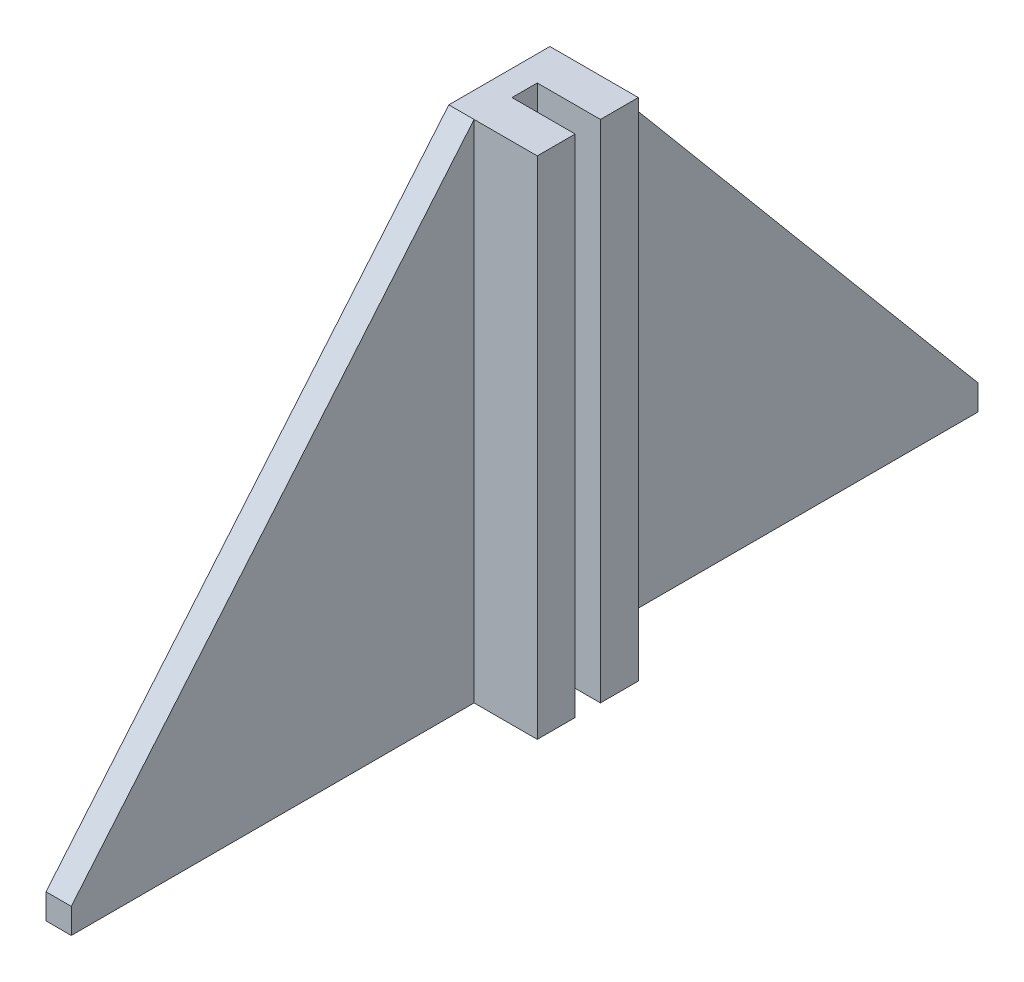
ISO-10303-21;
HEADER;
FILE_DESCRIPTION(('STEP AP214'),'2;1');
FILE_NAME('part.step','',(''),(''),'','','');
FILE_SCHEMA(('AUTOMOTIVE_DESIGN { 1 0 10303 214 1 1 1 1 }'));
ENDSEC;
DATA;
#1=APPLICATION_CONTEXT('core data for automotive mechanical design processes');
#2=APPLICATION_PROTOCOL_DEFINITION('international standard','automotive_design',2000,#1);
#3=PRODUCT_CONTEXT('',#1,'mechanical');
#4=PRODUCT('Part','Part','',(#3));
#5=PRODUCT_RELATED_PRODUCT_CATEGORY('part','',(#4));
#6=PRODUCT_DEFINITION_FORMATION('','',#4);
#7=PRODUCT_DEFINITION_CONTEXT('part definition',#1,'design');
#8=PRODUCT_DEFINITION('design','',#6,#7);
#9=PRODUCT_DEFINITION_SHAPE('','',#8);
#10=(LENGTH_UNIT() NAMED_UNIT(*) SI_UNIT(.MILLI.,.METRE.));
#11=(NAMED_UNIT(*) PLANE_ANGLE_UNIT() SI_UNIT($,.RADIAN.));
#12=(NAMED_UNIT(*) SI_UNIT($,.STERADIAN.) SOLID_ANGLE_UNIT());
#13=UNCERTAINTY_MEASURE_WITH_UNIT(LENGTH_MEASURE(1.E-05),#10,'distance_accuracy_value','');
#14=(GEOMETRIC_REPRESENTATION_CONTEXT(3) GLOBAL_UNCERTAINTY_ASSIGNED_CONTEXT((#13)) GLOBAL_UNIT_ASSIGNED_CONTEXT((#10,
#11,#12)) REPRESENTATION_CONTEXT('',''));
#15=CARTESIAN_POINT('',(0.,0.,0.));
#16=DIRECTION('',(0.,0.,1.));
#17=DIRECTION('',(1.,0.,0.));
#18=AXIS2_PLACEMENT_3D('',#15,#16,#17);
#19=CARTESIAN_POINT('',(20.,0.,0.));
#20=DIRECTION('',(-1.,0.,0.));
#21=DIRECTION('',(0.,0.,1.));
#22=AXIS2_PLACEMENT_3D('',#19,#20,#21);
#23=PLANE('',#22);
#24=DIRECTION('',(0.,1.,0.));
#25=VECTOR('',#24,1.);
#26=CARTESIAN_POINT('',(20.,0.,-40.));
#27=LINE('',#26,#25);
#28=CARTESIAN_POINT('',(20.,0.,-40.));
#29=VERTEX_POINT('',#28);
#30=CARTESIAN_POINT('',(20.,400.,-40.));
#31=VERTEX_POINT('',#30);
#32=EDGE_CURVE('E161',#29,#31,#27,.T.);
#33=ORIENTED_EDGE('',*,*,#32,.F.);
#34=DIRECTION('',(0.,0.,-1.));
#35=VECTOR('',#34,1.);
#36=CARTESIAN_POINT('',(20.,0.,358.857859847365));
#37=LINE('',#36,#35);
#38=CARTESIAN_POINT('',(20.,0.,-358.857859847365));
#39=VERTEX_POINT('',#38);
#40=EDGE_CURVE('E224',#29,#39,#37,.T.);
#41=ORIENTED_EDGE('',*,*,#40,.T.);
#42=DIRECTION('',(0.,1.,0.));
#43=VECTOR('',#42,1.);
#44=CARTESIAN_POINT('',(20.,0.,-358.857859847365));
#45=LINE('',#44,#43);
#46=CARTESIAN_POINT('',(20.,20.,-358.857859847365));
#47=VERTEX_POINT('',#46);
#48=EDGE_CURVE('E207',#39,#47,#45,.T.);
#49=ORIENTED_EDGE('',*,*,#48,.T.);
#50=DIRECTION('',(0.,0.766044443118979,0.642787609686538));
#51=VECTOR('',#50,1.);
#52=CARTESIAN_POINT('',(20.,400.,-40.));
#53=LINE('',#52,#51);
#54=EDGE_CURVE('E211',#47,#31,#53,.T.);
#55=ORIENTED_EDGE('',*,*,#54,.T.);
#56=EDGE_LOOP('',(#33,#41,#49,#55));
#57=FACE_BOUND('',#56,.T.);
#58=ADVANCED_FACE('F41',(#57),#23,.F.);
#59=DIRECTION('',(0.,-1.,0.));
#60=VECTOR('',#59,1.);
#61=CARTESIAN_POINT('',(20.,400.,-10.));
#62=LINE('',#61,#60);
#63=CARTESIAN_POINT('',(20.,400.,-10.));
#64=VERTEX_POINT('',#63);
#65=CARTESIAN_POINT('',(20.,0.,-9.99999999999995));
#66=VERTEX_POINT('',#65);
#67=EDGE_CURVE('E57',#64,#66,#62,.T.);
#68=ORIENTED_EDGE('',*,*,#67,.F.);
#69=DIRECTION('',(0.,0.,1.));
#70=VECTOR('',#69,1.);
#71=CARTESIAN_POINT('',(20.,400.,40.));
#72=LINE('',#71,#70);
#73=CARTESIAN_POINT('',(20.,400.,10.));
#74=VERTEX_POINT('',#73);
#75=EDGE_CURVE('E215',#64,#74,#72,.T.);
#76=ORIENTED_EDGE('',*,*,#75,.T.);
#77=DIRECTION('',(0.,1.,0.));
#78=VECTOR('',#77,1.);
#79=CARTESIAN_POINT('',(20.,400.,10.));
#80=LINE('',#79,#78);
#81=CARTESIAN_POINT('',(20.,0.,9.99999999999995));
#82=VERTEX_POINT('',#81);
#83=EDGE_CURVE('E168',#82,#74,#80,.T.);
#84=ORIENTED_EDGE('',*,*,#83,.F.);
#85=EDGE_CURVE('E62',#82,#66,#37,.T.);
#86=ORIENTED_EDGE('',*,*,#85,.T.);
#87=EDGE_LOOP('',(#68,#76,#84,#86));
#88=FACE_BOUND('',#87,.T.);
#89=ADVANCED_FACE('F295',(#88),#23,.F.);
#90=DIRECTION('',(0.,-1.,0.));
#91=VECTOR('',#90,1.);
#92=CARTESIAN_POINT('',(20.,400.,40.));
#93=LINE('',#92,#91);
#94=CARTESIAN_POINT('',(20.,400.,40.));
#95=VERTEX_POINT('',#94);
#96=CARTESIAN_POINT('',(20.,0.,40.));
#97=VERTEX_POINT('',#96);
#98=EDGE_CURVE('E163',#95,#97,#93,.T.);
#99=ORIENTED_EDGE('',*,*,#98,.F.);
#100=DIRECTION('',(0.,-0.766044443118979,0.642787609686538));
#101=VECTOR('',#100,1.);
#102=CARTESIAN_POINT('',(20.,400.,40.));
#103=LINE('',#102,#101);
#104=CARTESIAN_POINT('',(20.,20.,358.857859847365));
#105=VERTEX_POINT('',#104);
#106=EDGE_CURVE('E218',#95,#105,#103,.T.);
#107=ORIENTED_EDGE('',*,*,#106,.T.);
#108=DIRECTION('',(0.,-1.,0.));
#109=VECTOR('',#108,1.);
#110=CARTESIAN_POINT('',(20.,0.,358.857859847365));
#111=LINE('',#110,#109);
#112=CARTESIAN_POINT('',(20.,0.,358.857859847365));
#113=VERTEX_POINT('',#112);
#114=EDGE_CURVE('E221',#105,#113,#111,.T.);
#115=ORIENTED_EDGE('',*,*,#114,.T.);
#116=EDGE_CURVE('E225',#113,#97,#37,.T.);
#117=ORIENTED_EDGE('',*,*,#116,.T.);
#118=EDGE_LOOP('',(#99,#107,#115,#117));
#119=FACE_BOUND('',#118,.T.);
#120=ADVANCED_FACE('F281',(#119),#23,.F.);
#121=CARTESIAN_POINT('',(20.,0.,-358.857859847365));
#122=DIRECTION('',(0.,0.,1.));
#123=DIRECTION('',(1.,0.,0.));
#124=AXIS2_PLACEMENT_3D('',#121,#122,#123);
#125=PLANE('',#124);
#126=DIRECTION('',(0.,1.,0.));
#127=VECTOR('',#126,1.);
#128=CARTESIAN_POINT('',(0.,0.,-358.857859847365));
#129=LINE('',#128,#127);
#130=CARTESIAN_POINT('',(0.,0.,-358.857859847365));
#131=VERTEX_POINT('',#130);
#132=CARTESIAN_POINT('',(0.,20.,-358.857859847365));
#133=VERTEX_POINT('',#132);
#134=EDGE_CURVE('E206',#131,#133,#129,.T.);
#135=ORIENTED_EDGE('',*,*,#134,.T.);
#136=DIRECTION('',(-1.,0.,0.));
#137=VECTOR('',#136,1.);
#138=CARTESIAN_POINT('',(20.,20.,-358.857859847365));
#139=LINE('',#138,#137);
#140=EDGE_CURVE('E11',#47,#133,#139,.T.);
#141=ORIENTED_EDGE('',*,*,#140,.F.);
#142=ORIENTED_EDGE('',*,*,#48,.F.);
#143=DIRECTION('',(-1.,0.,0.));
#144=VECTOR('',#143,1.);
#145=CARTESIAN_POINT('',(20.,0.,-358.857859847365));
#146=LINE('',#145,#144);
#147=EDGE_CURVE('E228',#39,#131,#146,.T.);
#148=ORIENTED_EDGE('',*,*,#147,.T.);
#149=EDGE_LOOP('',(#135,#141,#142,#148));
#150=FACE_BOUND('',#149,.T.);
#151=ADVANCED_FACE('F43',(#150),#125,.F.);
#152=CARTESIAN_POINT('',(20.,400.,-40.));
#153=DIRECTION('',(0.,-0.642787609686538,0.766044443118979));
#154=DIRECTION('',(0.,-0.766044443118979,-0.642787609686538));
#155=AXIS2_PLACEMENT_3D('',#152,#153,#154);
#156=PLANE('',#155);
#157=DIRECTION('',(0.,0.766044443118979,0.642787609686538));
#158=VECTOR('',#157,1.);
#159=CARTESIAN_POINT('',(0.,400.,-40.));
#160=LINE('',#159,#158);
#161=CARTESIAN_POINT('',(0.,400.,-40.));
#162=VERTEX_POINT('',#161);
#163=EDGE_CURVE('E232',#133,#162,#160,.T.);
#164=ORIENTED_EDGE('',*,*,#163,.T.);
#165=DIRECTION('',(-1.,0.,0.));
#166=VECTOR('',#165,1.);
#167=CARTESIAN_POINT('',(20.,400.,-40.));
#168=LINE('',#167,#166);
#169=EDGE_CURVE('E50',#31,#162,#168,.T.);
#170=ORIENTED_EDGE('',*,*,#169,.F.);
#171=ORIENTED_EDGE('',*,*,#54,.F.);
#172=ORIENTED_EDGE('',*,*,#140,.T.);
#173=EDGE_LOOP('',(#164,#170,#171,#172));
#174=FACE_BOUND('',#173,.T.);
#175=ADVANCED_FACE('F307',(#174),#156,.F.);
#176=CARTESIAN_POINT('',(20.,400.,40.));
#177=DIRECTION('',(0.,-1.,0.));
#178=DIRECTION('',(0.,0.,-1.));
#179=AXIS2_PLACEMENT_3D('',#176,#177,#178);
#180=PLANE('',#179);
#181=DIRECTION('',(0.,0.,1.));
#182=VECTOR('',#181,1.);
#183=CARTESIAN_POINT('',(0.,400.,40.));
#184=LINE('',#183,#182);
#185=CARTESIAN_POINT('',(0.,400.,40.));
#186=VERTEX_POINT('',#185);
#187=EDGE_CURVE('E235',#162,#186,#184,.T.);
#188=ORIENTED_EDGE('',*,*,#187,.T.);
#189=DIRECTION('',(-1.,0.,0.));
#190=VECTOR('',#189,1.);
#191=CARTESIAN_POINT('',(20.,400.,40.));
#192=LINE('',#191,#190);
#193=EDGE_CURVE('E257',#95,#186,#192,.T.);
#194=ORIENTED_EDGE('',*,*,#193,.F.);
#195=DIRECTION('',(-1.,0.,0.));
#196=VECTOR('',#195,1.);
#197=CARTESIAN_POINT('',(70.,400.,40.));
#198=LINE('',#197,#196);
#199=CARTESIAN_POINT('',(70.,400.,40.));
#200=VERTEX_POINT('',#199);
#201=EDGE_CURVE('E186',#200,#95,#198,.T.);
#202=ORIENTED_EDGE('',*,*,#201,.F.);
#203=DIRECTION('',(0.,0.,1.));
#204=VECTOR('',#203,1.);
#205=CARTESIAN_POINT('',(70.,400.,40.));
#206=LINE('',#205,#204);
#207=CARTESIAN_POINT('',(70.,400.,10.));
#208=VERTEX_POINT('',#207);
#209=EDGE_CURVE('E184',#208,#200,#206,.T.);
#210=ORIENTED_EDGE('',*,*,#209,.F.);
#211=DIRECTION('',(-1.,0.,0.));
#212=VECTOR('',#211,1.);
#213=CARTESIAN_POINT('',(70.,400.,10.));
#214=LINE('',#213,#212);
#215=EDGE_CURVE('E194',#208,#74,#214,.T.);
#216=ORIENTED_EDGE('',*,*,#215,.T.);
#217=ORIENTED_EDGE('',*,*,#75,.F.);
#218=DIRECTION('',(-1.,0.,0.));
#219=VECTOR('',#218,1.);
#220=CARTESIAN_POINT('',(70.,400.,-10.));
#221=LINE('',#220,#219);
#222=CARTESIAN_POINT('',(70.,400.,-10.));
#223=VERTEX_POINT('',#222);
#224=EDGE_CURVE('E143',#223,#64,#221,.T.);
#225=ORIENTED_EDGE('',*,*,#224,.F.);
#226=DIRECTION('',(0.,0.,1.));
#227=VECTOR('',#226,1.);
#228=CARTESIAN_POINT('',(70.,400.,-40.));
#229=LINE('',#228,#227);
#230=CARTESIAN_POINT('',(70.,400.,-40.));
#231=VERTEX_POINT('',#230);
#232=EDGE_CURVE('E135',#231,#223,#229,.T.);
#233=ORIENTED_EDGE('',*,*,#232,.F.);
#234=DIRECTION('',(-1.,0.,0.));
#235=VECTOR('',#234,1.);
#236=CARTESIAN_POINT('',(70.,400.,-40.));
#237=LINE('',#236,#235);
#238=EDGE_CURVE('E140',#231,#31,#237,.T.);
#239=ORIENTED_EDGE('',*,*,#238,.T.);
#240=ORIENTED_EDGE('',*,*,#169,.T.);
#241=EDGE_LOOP('',(#188,#194,#202,#210,#216,#217,#225,#233,#239,#240));
#242=FACE_BOUND('',#241,.T.);
#243=ADVANCED_FACE('F137',(#242),#180,.F.);
#244=CARTESIAN_POINT('',(20.,400.,40.));
#245=DIRECTION('',(0.,-0.642787609686538,-0.766044443118979));
#246=DIRECTION('',(0.,0.766044443118979,-0.642787609686538));
#247=AXIS2_PLACEMENT_3D('',#244,#245,#246);
#248=PLANE('',#247);
#249=DIRECTION('',(0.,-0.766044443118979,0.642787609686538));
#250=VECTOR('',#249,1.);
#251=CARTESIAN_POINT('',(0.,400.,40.));
#252=LINE('',#251,#250);
#253=CARTESIAN_POINT('',(0.,20.,358.857859847365));
#254=VERTEX_POINT('',#253);
#255=EDGE_CURVE('E238',#186,#254,#252,.T.);
#256=ORIENTED_EDGE('',*,*,#255,.T.);
#257=DIRECTION('',(-1.,0.,0.));
#258=VECTOR('',#257,1.);
#259=CARTESIAN_POINT('',(20.,20.,358.857859847365));
#260=LINE('',#259,#258);
#261=EDGE_CURVE('E253',#105,#254,#260,.T.);
#262=ORIENTED_EDGE('',*,*,#261,.F.);
#263=ORIENTED_EDGE('',*,*,#106,.F.);
#264=ORIENTED_EDGE('',*,*,#193,.T.);
#265=EDGE_LOOP('',(#256,#262,#263,#264));
#266=FACE_BOUND('',#265,.T.);
#267=ADVANCED_FACE('F273',(#266),#248,.F.);
#268=CARTESIAN_POINT('',(20.,0.,358.857859847365));
#269=DIRECTION('',(0.,0.,-1.));
#270=DIRECTION('',(-1.,0.,0.));
#271=AXIS2_PLACEMENT_3D('',#268,#269,#270);
#272=PLANE('',#271);
#273=DIRECTION('',(0.,-1.,0.));
#274=VECTOR('',#273,1.);
#275=CARTESIAN_POINT('',(0.,0.,358.857859847365));
#276=LINE('',#275,#274);
#277=CARTESIAN_POINT('',(0.,0.,358.857859847365));
#278=VERTEX_POINT('',#277);
#279=EDGE_CURVE('E241',#254,#278,#276,.T.);
#280=ORIENTED_EDGE('',*,*,#279,.T.);
#281=DIRECTION('',(-1.,0.,0.));
#282=VECTOR('',#281,1.);
#283=CARTESIAN_POINT('',(20.,0.,358.857859847365));
#284=LINE('',#283,#282);
#285=EDGE_CURVE('E249',#113,#278,#284,.T.);
#286=ORIENTED_EDGE('',*,*,#285,.F.);
#287=ORIENTED_EDGE('',*,*,#114,.F.);
#288=ORIENTED_EDGE('',*,*,#261,.T.);
#289=EDGE_LOOP('',(#280,#286,#287,#288));
#290=FACE_BOUND('',#289,.T.);
#291=ADVANCED_FACE('F277',(#290),#272,.F.);
#292=CARTESIAN_POINT('',(20.,0.,358.857859847365));
#293=DIRECTION('',(0.,1.,0.));
#294=DIRECTION('',(0.,0.,1.));
#295=AXIS2_PLACEMENT_3D('',#292,#293,#294);
#296=PLANE('',#295);
#297=DIRECTION('',(0.,0.,-1.));
#298=VECTOR('',#297,1.);
#299=CARTESIAN_POINT('',(0.,0.,358.857859847365));
#300=LINE('',#299,#298);
#301=EDGE_CURVE('E212',#278,#131,#300,.T.);
#302=ORIENTED_EDGE('',*,*,#301,.T.);
#303=ORIENTED_EDGE('',*,*,#147,.F.);
#304=ORIENTED_EDGE('',*,*,#40,.F.);
#305=DIRECTION('',(-1.,0.,0.));
#306=VECTOR('',#305,1.);
#307=CARTESIAN_POINT('',(70.,0.,-40.));
#308=LINE('',#307,#306);
#309=CARTESIAN_POINT('',(70.,0.,-40.));
#310=VERTEX_POINT('',#309);
#311=EDGE_CURVE('E442',#310,#29,#308,.T.);
#312=ORIENTED_EDGE('',*,*,#311,.F.);
#313=DIRECTION('',(0.,0.,-1.));
#314=VECTOR('',#313,1.);
#315=CARTESIAN_POINT('',(70.,0.,-10.));
#316=LINE('',#315,#314);
#317=CARTESIAN_POINT('',(70.,0.,-10.));
#318=VERTEX_POINT('',#317);
#319=EDGE_CURVE('E153',#318,#310,#316,.T.);
#320=ORIENTED_EDGE('',*,*,#319,.F.);
#321=DIRECTION('',(-1.,0.,0.));
#322=VECTOR('',#321,1.);
#323=CARTESIAN_POINT('',(70.,0.,-10.));
#324=LINE('',#323,#322);
#325=EDGE_CURVE('E170',#318,#66,#324,.T.);
#326=ORIENTED_EDGE('',*,*,#325,.T.);
#327=ORIENTED_EDGE('',*,*,#85,.F.);
#328=DIRECTION('',(-1.,0.,0.));
#329=VECTOR('',#328,1.);
#330=CARTESIAN_POINT('',(70.,0.,9.99999999999995));
#331=LINE('',#330,#329);
#332=CARTESIAN_POINT('',(70.,0.,9.99999999999995));
#333=VERTEX_POINT('',#332);
#334=EDGE_CURVE('E198',#333,#82,#331,.T.);
#335=ORIENTED_EDGE('',*,*,#334,.F.);
#336=DIRECTION('',(0.,0.,-1.));
#337=VECTOR('',#336,1.);
#338=CARTESIAN_POINT('',(70.,0.,40.));
#339=LINE('',#338,#337);
#340=CARTESIAN_POINT('',(70.,0.,40.));
#341=VERTEX_POINT('',#340);
#342=EDGE_CURVE('E178',#341,#333,#339,.T.);
#343=ORIENTED_EDGE('',*,*,#342,.F.);
#344=DIRECTION('',(-1.,0.,0.));
#345=VECTOR('',#344,1.);
#346=CARTESIAN_POINT('',(70.,0.,40.));
#347=LINE('',#346,#345);
#348=EDGE_CURVE('E202',#341,#97,#347,.T.);
#349=ORIENTED_EDGE('',*,*,#348,.T.);
#350=ORIENTED_EDGE('',*,*,#116,.F.);
#351=ORIENTED_EDGE('',*,*,#285,.T.);
#352=EDGE_LOOP('',(#302,#303,#304,#312,#320,#326,#327,#335,#343,#349,#350,#351));
#353=FACE_BOUND('',#352,.T.);
#354=ADVANCED_FACE('F298',(#353),#296,.F.);
#355=CARTESIAN_POINT('',(0.,0.,0.));
#356=DIRECTION('',(-1.,0.,0.));
#357=DIRECTION('',(0.,0.,1.));
#358=AXIS2_PLACEMENT_3D('',#355,#356,#357);
#359=PLANE('',#358);
#360=ORIENTED_EDGE('',*,*,#134,.F.);
#361=ORIENTED_EDGE('',*,*,#301,.F.);
#362=ORIENTED_EDGE('',*,*,#279,.F.);
#363=ORIENTED_EDGE('',*,*,#255,.F.);
#364=ORIENTED_EDGE('',*,*,#187,.F.);
#365=ORIENTED_EDGE('',*,*,#163,.F.);
#366=EDGE_LOOP('',(#360,#361,#362,#363,#364,#365));
#367=FACE_BOUND('',#366,.T.);
#368=ADVANCED_FACE('F268',(#367),#359,.T.);
#369=CARTESIAN_POINT('',(70.,400.,40.));
#370=DIRECTION('',(0.,0.,-1.));
#371=DIRECTION('',(0.,1.,0.));
#372=AXIS2_PLACEMENT_3D('',#369,#370,#371);
#373=PLANE('',#372);
#374=ORIENTED_EDGE('',*,*,#98,.T.);
#375=ORIENTED_EDGE('',*,*,#348,.F.);
#376=DIRECTION('',(0.,-1.,0.));
#377=VECTOR('',#376,1.);
#378=CARTESIAN_POINT('',(70.,400.,40.));
#379=LINE('',#378,#377);
#380=EDGE_CURVE('E174',#200,#341,#379,.T.);
#381=ORIENTED_EDGE('',*,*,#380,.F.);
#382=ORIENTED_EDGE('',*,*,#201,.T.);
#383=EDGE_LOOP('',(#374,#375,#381,#382));
#384=FACE_BOUND('',#383,.T.);
#385=ADVANCED_FACE('F285',(#384),#373,.F.);
#386=CARTESIAN_POINT('',(70.,400.,10.));
#387=DIRECTION('',(0.,0.,1.));
#388=DIRECTION('',(0.,-1.,0.));
#389=AXIS2_PLACEMENT_3D('',#386,#387,#388);
#390=PLANE('',#389);
#391=ORIENTED_EDGE('',*,*,#83,.T.);
#392=ORIENTED_EDGE('',*,*,#215,.F.);
#393=DIRECTION('',(0.,1.,0.));
#394=VECTOR('',#393,1.);
#395=CARTESIAN_POINT('',(70.,400.,10.));
#396=LINE('',#395,#394);
#397=EDGE_CURVE('E181',#333,#208,#396,.T.);
#398=ORIENTED_EDGE('',*,*,#397,.F.);
#399=ORIENTED_EDGE('',*,*,#334,.T.);
#400=EDGE_LOOP('',(#391,#392,#398,#399));
#401=FACE_BOUND('',#400,.T.);
#402=ADVANCED_FACE('F294',(#401),#390,.F.);
#403=CARTESIAN_POINT('',(70.,0.,0.));
#404=DIRECTION('',(1.,0.,0.));
#405=DIRECTION('',(0.,0.,-1.));
#406=AXIS2_PLACEMENT_3D('',#403,#404,#405);
#407=PLANE('',#406);
#408=ORIENTED_EDGE('',*,*,#380,.T.);
#409=ORIENTED_EDGE('',*,*,#342,.T.);
#410=ORIENTED_EDGE('',*,*,#397,.T.);
#411=ORIENTED_EDGE('',*,*,#209,.T.);
#412=EDGE_LOOP('',(#408,#409,#410,#411));
#413=FACE_BOUND('',#412,.T.);
#414=ADVANCED_FACE('F290',(#413),#407,.T.);
#415=CARTESIAN_POINT('',(70.,0.,-40.));
#416=DIRECTION('',(0.,0.,1.));
#417=DIRECTION('',(0.,-1.,0.));
#418=AXIS2_PLACEMENT_3D('',#415,#416,#417);
#419=PLANE('',#418);
#420=ORIENTED_EDGE('',*,*,#32,.T.);
#421=ORIENTED_EDGE('',*,*,#238,.F.);
#422=DIRECTION('',(0.,1.,0.));
#423=VECTOR('',#422,1.);
#424=CARTESIAN_POINT('',(70.,0.,-40.));
#425=LINE('',#424,#423);
#426=EDGE_CURVE('E148',#310,#231,#425,.T.);
#427=ORIENTED_EDGE('',*,*,#426,.F.);
#428=ORIENTED_EDGE('',*,*,#311,.T.);
#429=EDGE_LOOP('',(#420,#421,#427,#428));
#430=FACE_BOUND('',#429,.T.);
#431=ADVANCED_FACE('F159',(#430),#419,.F.);
#432=CARTESIAN_POINT('',(70.,400.,-10.));
#433=DIRECTION('',(0.,0.,-1.));
#434=DIRECTION('',(0.,1.,0.));
#435=AXIS2_PLACEMENT_3D('',#432,#433,#434);
#436=PLANE('',#435);
#437=ORIENTED_EDGE('',*,*,#67,.T.);
#438=ORIENTED_EDGE('',*,*,#325,.F.);
#439=DIRECTION('',(0.,-1.,0.));
#440=VECTOR('',#439,1.);
#441=CARTESIAN_POINT('',(70.,400.,-10.));
#442=LINE('',#441,#440);
#443=EDGE_CURVE('E147',#223,#318,#442,.T.);
#444=ORIENTED_EDGE('',*,*,#443,.F.);
#445=ORIENTED_EDGE('',*,*,#224,.T.);
#446=EDGE_LOOP('',(#437,#438,#444,#445));
#447=FACE_BOUND('',#446,.T.);
#448=ADVANCED_FACE('F413',(#447),#436,.F.);
#449=CARTESIAN_POINT('',(70.,0.,0.));
#450=DIRECTION('',(1.,0.,0.));
#451=DIRECTION('',(0.,0.,-1.));
#452=AXIS2_PLACEMENT_3D('',#449,#450,#451);
#453=PLANE('',#452);
#454=ORIENTED_EDGE('',*,*,#426,.T.);
#455=ORIENTED_EDGE('',*,*,#232,.T.);
#456=ORIENTED_EDGE('',*,*,#443,.T.);
#457=ORIENTED_EDGE('',*,*,#319,.T.);
#458=EDGE_LOOP('',(#454,#455,#456,#457));
#459=FACE_BOUND('',#458,.T.);
#460=ADVANCED_FACE('F151',(#459),#453,.T.);
#461=CLOSED_SHELL('',(#58,#89,#120,#151,#175,#243,#267,#291,#354,#368,#385,#402,#414,#431,#448,#460));
#462=MANIFOLD_SOLID_BREP('B2',#461);
#463=ADVANCED_BREP_SHAPE_REPRESENTATION('',(#18,#462),#14);
#464=SHAPE_DEFINITION_REPRESENTATION(#9,#463);
ENDSEC;
END-ISO-10303-21;
